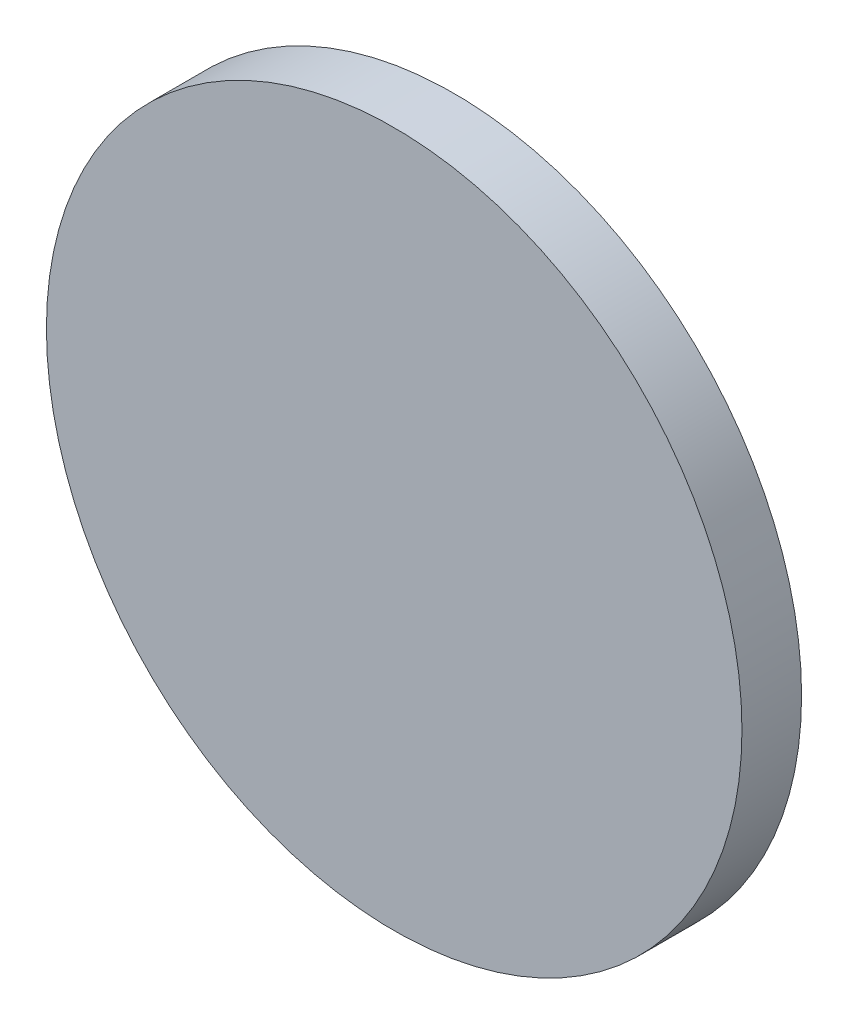
ISO-10303-21;
HEADER;
FILE_DESCRIPTION(('STEP AP214'),'2;1');
FILE_NAME('part.step','',(''),(''),'','','');
FILE_SCHEMA(('AUTOMOTIVE_DESIGN { 1 0 10303 214 1 1 1 1 }'));
ENDSEC;
DATA;
#1=APPLICATION_CONTEXT('core data for automotive mechanical design processes');
#2=APPLICATION_PROTOCOL_DEFINITION('international standard','automotive_design',2000,#1);
#3=PRODUCT_CONTEXT('',#1,'mechanical');
#4=PRODUCT('Part','Part','',(#3));
#5=PRODUCT_RELATED_PRODUCT_CATEGORY('part','',(#4));
#6=PRODUCT_DEFINITION_FORMATION('','',#4);
#7=PRODUCT_DEFINITION_CONTEXT('part definition',#1,'design');
#8=PRODUCT_DEFINITION('design','',#6,#7);
#9=PRODUCT_DEFINITION_SHAPE('','',#8);
#10=(LENGTH_UNIT() NAMED_UNIT(*) SI_UNIT(.MILLI.,.METRE.));
#11=(NAMED_UNIT(*) PLANE_ANGLE_UNIT() SI_UNIT($,.RADIAN.));
#12=(NAMED_UNIT(*) SI_UNIT($,.STERADIAN.) SOLID_ANGLE_UNIT());
#13=UNCERTAINTY_MEASURE_WITH_UNIT(LENGTH_MEASURE(1.E-05),#10,'distance_accuracy_value','');
#14=(GEOMETRIC_REPRESENTATION_CONTEXT(3) GLOBAL_UNCERTAINTY_ASSIGNED_CONTEXT((#13)) GLOBAL_UNIT_ASSIGNED_CONTEXT((#10,
#11,#12)) REPRESENTATION_CONTEXT('',''));
#15=CARTESIAN_POINT('',(0.,0.,0.));
#16=DIRECTION('',(0.,0.,1.));
#17=DIRECTION('',(1.,0.,0.));
#18=AXIS2_PLACEMENT_3D('',#15,#16,#17);
#19=CARTESIAN_POINT('',(5.3721,8.5979,0.79916));
#20=DIRECTION('',(0.,0.,1.));
#21=DIRECTION('',(1.,0.,0.));
#22=AXIS2_PLACEMENT_3D('',#19,#20,#21);
#23=PLANE('',#22);
#24=CARTESIAN_POINT('',(5.3721,8.5979,0.79916));
#25=DIRECTION('',(0.,0.,1.));
#26=DIRECTION('',(1.,0.,0.));
#27=AXIS2_PLACEMENT_3D('',#24,#25,#26);
#28=CIRCLE('',#27,0.200024667);
#29=CARTESIAN_POINT('',(5.572124667,8.5979,0.79916));
#30=VERTEX_POINT('',#29);
#31=EDGE_CURVE('E18',#30,#30,#28,.F.);
#32=ORIENTED_EDGE('',*,*,#31,.F.);
#33=EDGE_LOOP('',(#32));
#34=FACE_BOUND('',#33,.T.);
#35=ADVANCED_FACE('F15',(#34),#23,.T.);
#36=CARTESIAN_POINT('',(5.3721,8.5979,0.76487));
#37=DIRECTION('',(0.,0.,1.));
#38=DIRECTION('',(1.,0.,0.));
#39=AXIS2_PLACEMENT_3D('',#36,#37,#38);
#40=CYLINDRICAL_SURFACE('',#39,0.200024667);
#41=ORIENTED_EDGE('',*,*,#31,.T.);
#42=EDGE_LOOP('',(#41));
#43=FACE_BOUND('',#42,.T.);
#44=CARTESIAN_POINT('',(5.3721,8.5979,0.76487));
#45=DIRECTION('',(0.,0.,1.));
#46=DIRECTION('',(1.,0.,0.));
#47=AXIS2_PLACEMENT_3D('',#44,#45,#46);
#48=CIRCLE('',#47,0.200024667);
#49=CARTESIAN_POINT('',(5.572124667,8.5979,0.76487));
#50=VERTEX_POINT('',#49);
#51=EDGE_CURVE('E10',#50,#50,#48,.F.);
#52=ORIENTED_EDGE('',*,*,#51,.F.);
#53=EDGE_LOOP('',(#52));
#54=FACE_BOUND('',#53,.T.);
#55=ADVANCED_FACE('F27',(#43,#54),#40,.T.);
#56=CARTESIAN_POINT('',(5.3721,8.5979,0.76487));
#57=DIRECTION('',(0.,0.,-1.));
#58=DIRECTION('',(-1.,0.,0.));
#59=AXIS2_PLACEMENT_3D('',#56,#57,#58);
#60=PLANE('',#59);
#61=ORIENTED_EDGE('',*,*,#51,.T.);
#62=EDGE_LOOP('',(#61));
#63=FACE_BOUND('',#62,.T.);
#64=ADVANCED_FACE('F35',(#63),#60,.T.);
#65=CLOSED_SHELL('',(#35,#55,#64));
#66=MANIFOLD_SOLID_BREP('B1',#65);
#67=ADVANCED_BREP_SHAPE_REPRESENTATION('',(#18,#66),#14);
#68=SHAPE_DEFINITION_REPRESENTATION(#9,#67);
ENDSEC;
END-ISO-10303-21;
